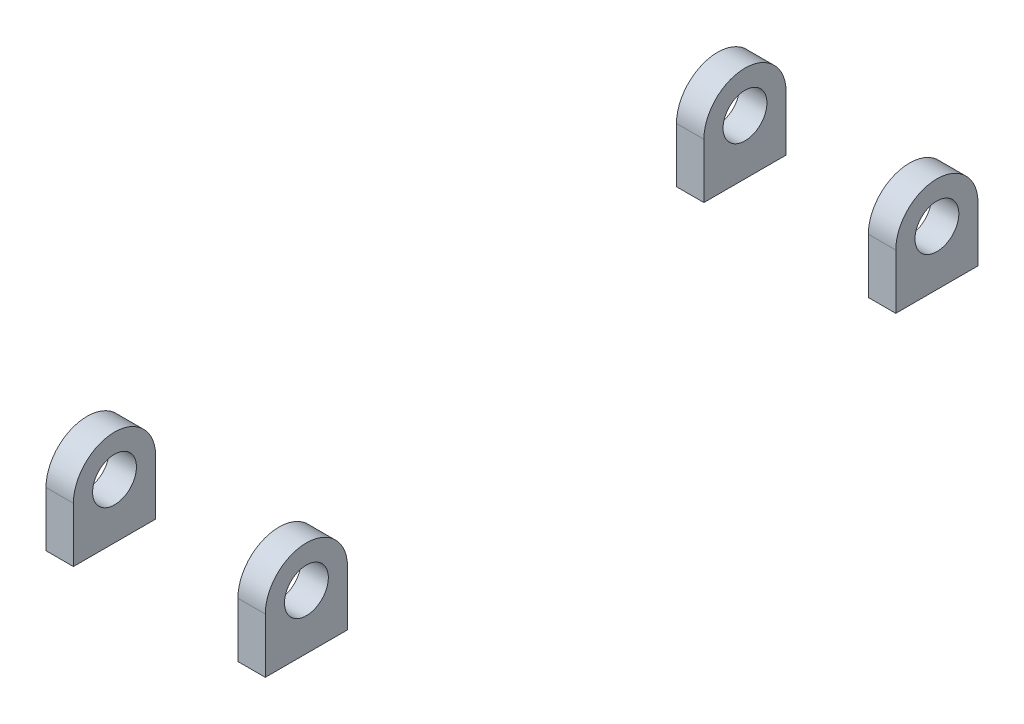
ISO-10303-21;
HEADER;
FILE_DESCRIPTION(('STEP AP214'),'2;1');
FILE_NAME('part.step','',(''),(''),'','','');
FILE_SCHEMA(('AUTOMOTIVE_DESIGN { 1 0 10303 214 1 1 1 1 }'));
ENDSEC;
DATA;
#1=APPLICATION_CONTEXT('core data for automotive mechanical design processes');
#2=APPLICATION_PROTOCOL_DEFINITION('international standard','automotive_design',2000,#1);
#3=PRODUCT_CONTEXT('',#1,'mechanical');
#4=PRODUCT('Part','Part','',(#3));
#5=PRODUCT_RELATED_PRODUCT_CATEGORY('part','',(#4));
#6=PRODUCT_DEFINITION_FORMATION('','',#4);
#7=PRODUCT_DEFINITION_CONTEXT('part definition',#1,'design');
#8=PRODUCT_DEFINITION('design','',#6,#7);
#9=PRODUCT_DEFINITION_SHAPE('','',#8);
#10=(LENGTH_UNIT() NAMED_UNIT(*) SI_UNIT(.MILLI.,.METRE.));
#11=(NAMED_UNIT(*) PLANE_ANGLE_UNIT() SI_UNIT($,.RADIAN.));
#12=(NAMED_UNIT(*) SI_UNIT($,.STERADIAN.) SOLID_ANGLE_UNIT());
#13=UNCERTAINTY_MEASURE_WITH_UNIT(LENGTH_MEASURE(1.E-05),#10,'distance_accuracy_value','');
#14=(GEOMETRIC_REPRESENTATION_CONTEXT(3) GLOBAL_UNCERTAINTY_ASSIGNED_CONTEXT((#13)) GLOBAL_UNIT_ASSIGNED_CONTEXT((#10,
#11,#12)) REPRESENTATION_CONTEXT('',''));
#15=CARTESIAN_POINT('',(0.,0.,0.));
#16=DIRECTION('',(0.,0.,1.));
#17=DIRECTION('',(1.,0.,0.));
#18=AXIS2_PLACEMENT_3D('',#15,#16,#17);
#19=CARTESIAN_POINT('',(20.,20.,-31.163525116419));
#20=DIRECTION('',(0.,0.,-1.));
#21=DIRECTION('',(-1.,0.,0.));
#22=AXIS2_PLACEMENT_3D('',#19,#20,#21);
#23=PLANE('',#22);
#24=DIRECTION('',(-1.,0.,0.));
#25=VECTOR('',#24,1.);
#26=CARTESIAN_POINT('',(20.,10.,-31.163525116419));
#27=LINE('',#26,#25);
#28=CARTESIAN_POINT('',(20.,10.,-31.163525116419));
#29=VERTEX_POINT('',#28);
#30=CARTESIAN_POINT('',(15.,10.,-31.163525116419));
#31=VERTEX_POINT('',#30);
#32=EDGE_CURVE('E98',#29,#31,#27,.T.);
#33=ORIENTED_EDGE('',*,*,#32,.T.);
#34=DIRECTION('',(0.,-1.,0.));
#35=VECTOR('',#34,1.);
#36=CARTESIAN_POINT('',(15.,20.,-31.163525116419));
#37=LINE('',#36,#35);
#38=CARTESIAN_POINT('',(15.,0.,-31.163525116419));
#39=VERTEX_POINT('',#38);
#40=EDGE_CURVE('E118',#31,#39,#37,.T.);
#41=ORIENTED_EDGE('',*,*,#40,.T.);
#42=DIRECTION('',(1.,0.,0.));
#43=VECTOR('',#42,1.);
#44=CARTESIAN_POINT('',(20.,0.,-31.163525116419));
#45=LINE('',#44,#43);
#46=CARTESIAN_POINT('',(20.,0.,-31.163525116419));
#47=VERTEX_POINT('',#46);
#48=EDGE_CURVE('E64',#39,#47,#45,.T.);
#49=ORIENTED_EDGE('',*,*,#48,.T.);
#50=DIRECTION('',(0.,-1.,0.));
#51=VECTOR('',#50,1.);
#52=CARTESIAN_POINT('',(20.,20.,-31.163525116419));
#53=LINE('',#52,#51);
#54=EDGE_CURVE('E78',#29,#47,#53,.T.);
#55=ORIENTED_EDGE('',*,*,#54,.F.);
#56=EDGE_LOOP('',(#33,#41,#49,#55));
#57=FACE_BOUND('',#56,.T.);
#58=ADVANCED_FACE('F54',(#57),#23,.F.);
#59=CARTESIAN_POINT('',(20.,20.,-31.163525116419));
#60=DIRECTION('',(-1.,0.,0.));
#61=DIRECTION('',(0.,0.,1.));
#62=AXIS2_PLACEMENT_3D('',#59,#60,#61);
#63=PLANE('',#62);
#64=CARTESIAN_POINT('',(20.,10.,-38.663525116419));
#65=DIRECTION('',(-1.,0.,0.));
#66=DIRECTION('',(0.,0.,1.));
#67=AXIS2_PLACEMENT_3D('',#64,#65,#66);
#68=CIRCLE('',#67,4.00000000000001);
#69=CARTESIAN_POINT('',(20.,10.,-34.663525116419));
#70=VERTEX_POINT('',#69);
#71=EDGE_CURVE('E101',#70,#70,#68,.T.);
#72=ORIENTED_EDGE('',*,*,#71,.T.);
#73=EDGE_LOOP('',(#72));
#74=FACE_BOUND('',#73,.T.);
#75=DIRECTION('',(0.,-1.,0.));
#76=VECTOR('',#75,1.);
#77=CARTESIAN_POINT('',(20.,20.,-46.163525116419));
#78=LINE('',#77,#76);
#79=CARTESIAN_POINT('',(20.,10.,-46.163525116419));
#80=VERTEX_POINT('',#79);
#81=CARTESIAN_POINT('',(20.,0.,-46.163525116419));
#82=VERTEX_POINT('',#81);
#83=EDGE_CURVE('E107',#80,#82,#78,.T.);
#84=ORIENTED_EDGE('',*,*,#83,.F.);
#85=CARTESIAN_POINT('',(20.,10.,-38.663525116419));
#86=DIRECTION('',(1.,0.,0.));
#87=DIRECTION('',(0.,0.,1.));
#88=AXIS2_PLACEMENT_3D('',#85,#86,#87);
#89=CIRCLE('',#88,7.5);
#90=EDGE_CURVE('E95',#80,#29,#89,.T.);
#91=ORIENTED_EDGE('',*,*,#90,.T.);
#92=ORIENTED_EDGE('',*,*,#54,.T.);
#93=DIRECTION('',(0.,0.,-1.));
#94=VECTOR('',#93,1.);
#95=CARTESIAN_POINT('',(20.,0.,-31.163525116419));
#96=LINE('',#95,#94);
#97=EDGE_CURVE('E112',#47,#82,#96,.T.);
#98=ORIENTED_EDGE('',*,*,#97,.T.);
#99=EDGE_LOOP('',(#84,#91,#92,#98));
#100=FACE_BOUND('',#99,.T.);
#101=ADVANCED_FACE('F111',(#74,#100),#63,.F.);
#102=CARTESIAN_POINT('',(20.,20.,-46.163525116419));
#103=DIRECTION('',(0.,0.,1.));
#104=DIRECTION('',(1.,0.,0.));
#105=AXIS2_PLACEMENT_3D('',#102,#103,#104);
#106=PLANE('',#105);
#107=DIRECTION('',(0.,-1.,0.));
#108=VECTOR('',#107,1.);
#109=CARTESIAN_POINT('',(15.,20.,-46.163525116419));
#110=LINE('',#109,#108);
#111=CARTESIAN_POINT('',(15.,10.,-46.163525116419));
#112=VERTEX_POINT('',#111);
#113=CARTESIAN_POINT('',(15.,0.,-46.163525116419));
#114=VERTEX_POINT('',#113);
#115=EDGE_CURVE('E108',#112,#114,#110,.T.);
#116=ORIENTED_EDGE('',*,*,#115,.F.);
#117=DIRECTION('',(-1.,0.,0.));
#118=VECTOR('',#117,1.);
#119=CARTESIAN_POINT('',(20.,10.,-46.163525116419));
#120=LINE('',#119,#118);
#121=EDGE_CURVE('E71',#80,#112,#120,.T.);
#122=ORIENTED_EDGE('',*,*,#121,.F.);
#123=ORIENTED_EDGE('',*,*,#83,.T.);
#124=DIRECTION('',(-1.,0.,0.));
#125=VECTOR('',#124,1.);
#126=CARTESIAN_POINT('',(20.,0.,-46.163525116419));
#127=LINE('',#126,#125);
#128=EDGE_CURVE('E128',#82,#114,#127,.T.);
#129=ORIENTED_EDGE('',*,*,#128,.T.);
#130=EDGE_LOOP('',(#116,#122,#123,#129));
#131=FACE_BOUND('',#130,.T.);
#132=ADVANCED_FACE('F105',(#131),#106,.F.);
#133=CARTESIAN_POINT('',(15.,20.,-31.163525116419));
#134=DIRECTION('',(1.,0.,0.));
#135=DIRECTION('',(0.,0.,-1.));
#136=AXIS2_PLACEMENT_3D('',#133,#134,#135);
#137=PLANE('',#136);
#138=CARTESIAN_POINT('',(15.,10.,-38.663525116419));
#139=DIRECTION('',(1.,0.,0.));
#140=DIRECTION('',(0.,0.,-1.));
#141=AXIS2_PLACEMENT_3D('',#138,#139,#140);
#142=CIRCLE('',#141,4.00000000000001);
#143=CARTESIAN_POINT('',(15.,10.,-42.663525116419));
#144=VERTEX_POINT('',#143);
#145=EDGE_CURVE('E58',#144,#144,#142,.T.);
#146=ORIENTED_EDGE('',*,*,#145,.T.);
#147=EDGE_LOOP('',(#146));
#148=FACE_BOUND('',#147,.T.);
#149=ORIENTED_EDGE('',*,*,#40,.F.);
#150=CARTESIAN_POINT('',(15.,10.,-38.663525116419));
#151=DIRECTION('',(1.,0.,0.));
#152=DIRECTION('',(0.,0.,-1.));
#153=AXIS2_PLACEMENT_3D('',#150,#151,#152);
#154=CIRCLE('',#153,7.5);
#155=EDGE_CURVE('E12',#31,#112,#154,.F.);
#156=ORIENTED_EDGE('',*,*,#155,.T.);
#157=ORIENTED_EDGE('',*,*,#115,.T.);
#158=DIRECTION('',(0.,0.,1.));
#159=VECTOR('',#158,1.);
#160=CARTESIAN_POINT('',(15.,0.,-31.163525116419));
#161=LINE('',#160,#159);
#162=EDGE_CURVE('E124',#114,#39,#161,.T.);
#163=ORIENTED_EDGE('',*,*,#162,.T.);
#164=EDGE_LOOP('',(#149,#156,#157,#163));
#165=FACE_BOUND('',#164,.T.);
#166=ADVANCED_FACE('F141',(#148,#165),#137,.F.);
#167=CARTESIAN_POINT('',(0.,0.,0.));
#168=DIRECTION('',(0.,-1.,0.));
#169=DIRECTION('',(0.,0.,-1.));
#170=AXIS2_PLACEMENT_3D('',#167,#168,#169);
#171=PLANE('',#170);
#172=ORIENTED_EDGE('',*,*,#48,.F.);
#173=ORIENTED_EDGE('',*,*,#162,.F.);
#174=ORIENTED_EDGE('',*,*,#128,.F.);
#175=ORIENTED_EDGE('',*,*,#97,.F.);
#176=EDGE_LOOP('',(#172,#173,#174,#175));
#177=FACE_BOUND('',#176,.T.);
#178=ADVANCED_FACE('F56',(#177),#171,.T.);
#179=CARTESIAN_POINT('',(20.,10.,-38.663525116419));
#180=DIRECTION('',(-1.,0.,0.));
#181=DIRECTION('',(0.,0.,1.));
#182=AXIS2_PLACEMENT_3D('',#179,#180,#181);
#183=CYLINDRICAL_SURFACE('',#182,7.5);
#184=ORIENTED_EDGE('',*,*,#32,.F.);
#185=ORIENTED_EDGE('',*,*,#90,.F.);
#186=ORIENTED_EDGE('',*,*,#121,.T.);
#187=ORIENTED_EDGE('',*,*,#155,.F.);
#188=EDGE_LOOP('',(#184,#185,#186,#187));
#189=FACE_BOUND('',#188,.T.);
#190=ADVANCED_FACE('F96',(#189),#183,.T.);
#191=CARTESIAN_POINT('',(20.,10.,-38.663525116419));
#192=DIRECTION('',(-1.,0.,0.));
#193=DIRECTION('',(0.,0.,1.));
#194=AXIS2_PLACEMENT_3D('',#191,#192,#193);
#195=CYLINDRICAL_SURFACE('',#194,4.00000000000001);
#196=ORIENTED_EDGE('',*,*,#71,.F.);
#197=EDGE_LOOP('',(#196));
#198=FACE_BOUND('',#197,.T.);
#199=ORIENTED_EDGE('',*,*,#145,.F.);
#200=EDGE_LOOP('',(#199));
#201=FACE_BOUND('',#200,.T.);
#202=ADVANCED_FACE('F154',(#198,#201),#195,.F.);
#203=CLOSED_SHELL('',(#58,#101,#132,#166,#178,#190,#202));
#204=MANIFOLD_SOLID_BREP('B2',#203);
#205=CARTESIAN_POINT('',(20.,20.,83.836474883581));
#206=DIRECTION('',(0.,0.,-1.));
#207=DIRECTION('',(-1.,0.,0.));
#208=AXIS2_PLACEMENT_3D('',#205,#206,#207);
#209=PLANE('',#208);
#210=DIRECTION('',(-1.,0.,0.));
#211=VECTOR('',#210,1.);
#212=CARTESIAN_POINT('',(20.0000000000001,10.,83.836474883581));
#213=LINE('',#212,#211);
#214=CARTESIAN_POINT('',(20.,10.,83.836474883581));
#215=VERTEX_POINT('',#214);
#216=CARTESIAN_POINT('',(15.,10.,83.836474883581));
#217=VERTEX_POINT('',#216);
#218=EDGE_CURVE('E252',#215,#217,#213,.T.);
#219=ORIENTED_EDGE('',*,*,#218,.T.);
#220=DIRECTION('',(0.,-1.,0.));
#221=VECTOR('',#220,1.);
#222=CARTESIAN_POINT('',(15.,20.,83.836474883581));
#223=LINE('',#222,#221);
#224=CARTESIAN_POINT('',(15.,0.,83.836474883581));
#225=VERTEX_POINT('',#224);
#226=EDGE_CURVE('E300',#217,#225,#223,.T.);
#227=ORIENTED_EDGE('',*,*,#226,.T.);
#228=DIRECTION('',(1.,0.,0.));
#229=VECTOR('',#228,1.);
#230=CARTESIAN_POINT('',(20.,0.,83.836474883581));
#231=LINE('',#230,#229);
#232=CARTESIAN_POINT('',(20.,0.,83.836474883581));
#233=VERTEX_POINT('',#232);
#234=EDGE_CURVE('E298',#225,#233,#231,.T.);
#235=ORIENTED_EDGE('',*,*,#234,.T.);
#236=DIRECTION('',(0.,-1.,0.));
#237=VECTOR('',#236,1.);
#238=CARTESIAN_POINT('',(20.,20.,83.836474883581));
#239=LINE('',#238,#237);
#240=EDGE_CURVE('E296',#215,#233,#239,.T.);
#241=ORIENTED_EDGE('',*,*,#240,.F.);
#242=EDGE_LOOP('',(#219,#227,#235,#241));
#243=FACE_BOUND('',#242,.T.);
#244=ADVANCED_FACE('F237',(#243),#209,.F.);
#245=CARTESIAN_POINT('',(20.,20.,68.836474883581));
#246=DIRECTION('',(0.,0.,1.));
#247=DIRECTION('',(1.,0.,0.));
#248=AXIS2_PLACEMENT_3D('',#245,#246,#247);
#249=PLANE('',#248);
#250=DIRECTION('',(0.,-1.,0.));
#251=VECTOR('',#250,1.);
#252=CARTESIAN_POINT('',(15.,20.,68.836474883581));
#253=LINE('',#252,#251);
#254=CARTESIAN_POINT('',(15.,10.,68.836474883581));
#255=VERTEX_POINT('',#254);
#256=CARTESIAN_POINT('',(15.,0.,68.836474883581));
#257=VERTEX_POINT('',#256);
#258=EDGE_CURVE('E260',#255,#257,#253,.T.);
#259=ORIENTED_EDGE('',*,*,#258,.F.);
#260=DIRECTION('',(-1.,0.,0.));
#261=VECTOR('',#260,1.);
#262=CARTESIAN_POINT('',(20.,10.,68.836474883581));
#263=LINE('',#262,#261);
#264=CARTESIAN_POINT('',(20.,10.,68.836474883581));
#265=VERTEX_POINT('',#264);
#266=EDGE_CURVE('E280',#265,#255,#263,.T.);
#267=ORIENTED_EDGE('',*,*,#266,.F.);
#268=DIRECTION('',(0.,-1.,0.));
#269=VECTOR('',#268,1.);
#270=CARTESIAN_POINT('',(20.,20.,68.836474883581));
#271=LINE('',#270,#269);
#272=CARTESIAN_POINT('',(20.,0.,68.836474883581));
#273=VERTEX_POINT('',#272);
#274=EDGE_CURVE('E288',#265,#273,#271,.T.);
#275=ORIENTED_EDGE('',*,*,#274,.T.);
#276=DIRECTION('',(-1.,0.,0.));
#277=VECTOR('',#276,1.);
#278=CARTESIAN_POINT('',(20.,0.,68.836474883581));
#279=LINE('',#278,#277);
#280=EDGE_CURVE('E52',#273,#257,#279,.T.);
#281=ORIENTED_EDGE('',*,*,#280,.T.);
#282=EDGE_LOOP('',(#259,#267,#275,#281));
#283=FACE_BOUND('',#282,.T.);
#284=ADVANCED_FACE('F287',(#283),#249,.F.);
#285=CARTESIAN_POINT('',(15.,20.,68.836474883581));
#286=DIRECTION('',(1.,0.,0.));
#287=DIRECTION('',(0.,0.,-1.));
#288=AXIS2_PLACEMENT_3D('',#285,#286,#287);
#289=PLANE('',#288);
#290=CARTESIAN_POINT('',(15.,10.,76.336474883581));
#291=DIRECTION('',(1.,0.,0.));
#292=DIRECTION('',(0.,0.,-1.));
#293=AXIS2_PLACEMENT_3D('',#290,#291,#292);
#294=CIRCLE('',#293,4.00000000000001);
#295=CARTESIAN_POINT('',(15.,10.,72.336474883581));
#296=VERTEX_POINT('',#295);
#297=EDGE_CURVE('E284',#296,#296,#294,.T.);
#298=ORIENTED_EDGE('',*,*,#297,.T.);
#299=EDGE_LOOP('',(#298));
#300=FACE_BOUND('',#299,.T.);
#301=ORIENTED_EDGE('',*,*,#226,.F.);
#302=CARTESIAN_POINT('',(15.,10.,76.336474883581));
#303=DIRECTION('',(1.,0.,0.));
#304=DIRECTION('',(0.,0.,-1.));
#305=AXIS2_PLACEMENT_3D('',#302,#303,#304);
#306=CIRCLE('',#305,7.5);
#307=EDGE_CURVE('E310',#217,#255,#306,.F.);
#308=ORIENTED_EDGE('',*,*,#307,.T.);
#309=ORIENTED_EDGE('',*,*,#258,.T.);
#310=DIRECTION('',(0.,0.,1.));
#311=VECTOR('',#310,1.);
#312=CARTESIAN_POINT('',(15.,0.,68.836474883581));
#313=LINE('',#312,#311);
#314=EDGE_CURVE('E245',#257,#225,#313,.T.);
#315=ORIENTED_EDGE('',*,*,#314,.T.);
#316=EDGE_LOOP('',(#301,#308,#309,#315));
#317=FACE_BOUND('',#316,.T.);
#318=ADVANCED_FACE('F307',(#300,#317),#289,.F.);
#319=CARTESIAN_POINT('',(20.,20.,68.836474883581));
#320=DIRECTION('',(-1.,0.,0.));
#321=DIRECTION('',(0.,0.,1.));
#322=AXIS2_PLACEMENT_3D('',#319,#320,#321);
#323=PLANE('',#322);
#324=CARTESIAN_POINT('',(20.,10.,76.336474883581));
#325=DIRECTION('',(-1.,0.,0.));
#326=DIRECTION('',(0.,0.,1.));
#327=AXIS2_PLACEMENT_3D('',#324,#325,#326);
#328=CIRCLE('',#327,4.00000000000001);
#329=CARTESIAN_POINT('',(20.,10.,80.336474883581));
#330=VERTEX_POINT('',#329);
#331=EDGE_CURVE('E290',#330,#330,#328,.T.);
#332=ORIENTED_EDGE('',*,*,#331,.T.);
#333=EDGE_LOOP('',(#332));
#334=FACE_BOUND('',#333,.T.);
#335=ORIENTED_EDGE('',*,*,#274,.F.);
#336=CARTESIAN_POINT('',(20.,10.,76.336474883581));
#337=DIRECTION('',(1.,0.,0.));
#338=DIRECTION('',(0.,0.,1.));
#339=AXIS2_PLACEMENT_3D('',#336,#337,#338);
#340=CIRCLE('',#339,7.5);
#341=EDGE_CURVE('E277',#265,#215,#340,.T.);
#342=ORIENTED_EDGE('',*,*,#341,.T.);
#343=ORIENTED_EDGE('',*,*,#240,.T.);
#344=DIRECTION('',(0.,0.,-1.));
#345=VECTOR('',#344,1.);
#346=CARTESIAN_POINT('',(20.,0.,68.836474883581));
#347=LINE('',#346,#345);
#348=EDGE_CURVE('E294',#233,#273,#347,.T.);
#349=ORIENTED_EDGE('',*,*,#348,.T.);
#350=EDGE_LOOP('',(#335,#342,#343,#349));
#351=FACE_BOUND('',#350,.T.);
#352=ADVANCED_FACE('F292',(#334,#351),#323,.F.);
#353=CARTESIAN_POINT('',(0.,0.,0.));
#354=DIRECTION('',(0.,1.,0.));
#355=DIRECTION('',(0.,0.,1.));
#356=AXIS2_PLACEMENT_3D('',#353,#354,#355);
#357=PLANE('',#356);
#358=ORIENTED_EDGE('',*,*,#280,.F.);
#359=ORIENTED_EDGE('',*,*,#348,.F.);
#360=ORIENTED_EDGE('',*,*,#234,.F.);
#361=ORIENTED_EDGE('',*,*,#314,.F.);
#362=EDGE_LOOP('',(#358,#359,#360,#361));
#363=FACE_BOUND('',#362,.T.);
#364=ADVANCED_FACE('F239',(#363),#357,.F.);
#365=CARTESIAN_POINT('',(20.,10.,76.336474883581));
#366=DIRECTION('',(-1.,0.,0.));
#367=DIRECTION('',(0.,0.,1.));
#368=AXIS2_PLACEMENT_3D('',#365,#366,#367);
#369=CYLINDRICAL_SURFACE('',#368,4.00000000000001);
#370=ORIENTED_EDGE('',*,*,#331,.F.);
#371=EDGE_LOOP('',(#370));
#372=FACE_BOUND('',#371,.T.);
#373=ORIENTED_EDGE('',*,*,#297,.F.);
#374=EDGE_LOOP('',(#373));
#375=FACE_BOUND('',#374,.T.);
#376=ADVANCED_FACE('F321',(#372,#375),#369,.F.);
#377=CARTESIAN_POINT('',(20.,10.,76.336474883581));
#378=DIRECTION('',(-1.,0.,0.));
#379=DIRECTION('',(0.,0.,1.));
#380=AXIS2_PLACEMENT_3D('',#377,#378,#379);
#381=CYLINDRICAL_SURFACE('',#380,7.5);
#382=ORIENTED_EDGE('',*,*,#218,.F.);
#383=ORIENTED_EDGE('',*,*,#341,.F.);
#384=ORIENTED_EDGE('',*,*,#266,.T.);
#385=ORIENTED_EDGE('',*,*,#307,.F.);
#386=EDGE_LOOP('',(#382,#383,#384,#385));
#387=FACE_BOUND('',#386,.T.);
#388=ADVANCED_FACE('F279',(#387),#381,.T.);
#389=CLOSED_SHELL('',(#244,#284,#318,#352,#364,#376,#388));
#390=MANIFOLD_SOLID_BREP('B6',#389);
#391=CARTESIAN_POINT('',(-20.,20.,-31.163525116419));
#392=DIRECTION('',(0.,0.,-1.));
#393=DIRECTION('',(-1.,0.,0.));
#394=AXIS2_PLACEMENT_3D('',#391,#392,#393);
#395=PLANE('',#394);
#396=DIRECTION('',(-1.,0.,0.));
#397=VECTOR('',#396,1.);
#398=CARTESIAN_POINT('',(20.,10.,-31.163525116419));
#399=LINE('',#398,#397);
#400=CARTESIAN_POINT('',(-15.,10.,-31.163525116419));
#401=VERTEX_POINT('',#400);
#402=CARTESIAN_POINT('',(-20.,10.,-31.163525116419));
#403=VERTEX_POINT('',#402);
#404=EDGE_CURVE('E453',#401,#403,#399,.T.);
#405=ORIENTED_EDGE('',*,*,#404,.T.);
#406=DIRECTION('',(0.,-1.,0.));
#407=VECTOR('',#406,1.);
#408=CARTESIAN_POINT('',(-20.,20.,-31.163525116419));
#409=LINE('',#408,#407);
#410=CARTESIAN_POINT('',(-20.,0.,-31.163525116419));
#411=VERTEX_POINT('',#410);
#412=EDGE_CURVE('E429',#403,#411,#409,.T.);
#413=ORIENTED_EDGE('',*,*,#412,.T.);
#414=DIRECTION('',(1.,0.,0.));
#415=VECTOR('',#414,1.);
#416=CARTESIAN_POINT('',(-20.,0.,-31.163525116419));
#417=LINE('',#416,#415);
#418=CARTESIAN_POINT('',(-15.,0.,-31.163525116419));
#419=VERTEX_POINT('',#418);
#420=EDGE_CURVE('E414',#411,#419,#417,.T.);
#421=ORIENTED_EDGE('',*,*,#420,.T.);
#422=DIRECTION('',(0.,-1.,0.));
#423=VECTOR('',#422,1.);
#424=CARTESIAN_POINT('',(-15.,20.,-31.163525116419));
#425=LINE('',#424,#423);
#426=EDGE_CURVE('E469',#401,#419,#425,.T.);
#427=ORIENTED_EDGE('',*,*,#426,.F.);
#428=EDGE_LOOP('',(#405,#413,#421,#427));
#429=FACE_BOUND('',#428,.T.);
#430=ADVANCED_FACE('F405',(#429),#395,.F.);
#431=CARTESIAN_POINT('',(-20.,20.,-31.163525116419));
#432=DIRECTION('',(1.,0.,0.));
#433=DIRECTION('',(0.,0.,-1.));
#434=AXIS2_PLACEMENT_3D('',#431,#432,#433);
#435=PLANE('',#434);
#436=CARTESIAN_POINT('',(-20.,10.,-38.663525116419));
#437=DIRECTION('',(-1.,0.,0.));
#438=DIRECTION('',(0.,0.,1.));
#439=AXIS2_PLACEMENT_3D('',#436,#437,#438);
#440=CIRCLE('',#439,4.00000000000001);
#441=CARTESIAN_POINT('',(-20.,10.,-34.663525116419));
#442=VERTEX_POINT('',#441);
#443=EDGE_CURVE('E459',#442,#442,#440,.T.);
#444=ORIENTED_EDGE('',*,*,#443,.F.);
#445=EDGE_LOOP('',(#444));
#446=FACE_BOUND('',#445,.T.);
#447=ORIENTED_EDGE('',*,*,#412,.F.);
#448=CARTESIAN_POINT('',(-20.,10.,-38.663525116419));
#449=DIRECTION('',(1.,0.,0.));
#450=DIRECTION('',(0.,0.,1.));
#451=AXIS2_PLACEMENT_3D('',#448,#449,#450);
#452=CIRCLE('',#451,7.5);
#453=CARTESIAN_POINT('',(-20.,10.,-46.163525116419));
#454=VERTEX_POINT('',#453);
#455=EDGE_CURVE('E449',#454,#403,#452,.T.);
#456=ORIENTED_EDGE('',*,*,#455,.F.);
#457=DIRECTION('',(0.,-1.,0.));
#458=VECTOR('',#457,1.);
#459=CARTESIAN_POINT('',(-20.,20.,-46.163525116419));
#460=LINE('',#459,#458);
#461=CARTESIAN_POINT('',(-20.,0.,-46.163525116419));
#462=VERTEX_POINT('',#461);
#463=EDGE_CURVE('E457',#454,#462,#460,.T.);
#464=ORIENTED_EDGE('',*,*,#463,.T.);
#465=DIRECTION('',(0.,0.,1.));
#466=VECTOR('',#465,1.);
#467=CARTESIAN_POINT('',(-20.,0.,-31.163525116419));
#468=LINE('',#467,#466);
#469=EDGE_CURVE('E235',#462,#411,#468,.T.);
#470=ORIENTED_EDGE('',*,*,#469,.T.);
#471=EDGE_LOOP('',(#447,#456,#464,#470));
#472=FACE_BOUND('',#471,.T.);
#473=ADVANCED_FACE('F456',(#446,#472),#435,.F.);
#474=CARTESIAN_POINT('',(-15.,20.,-31.163525116419));
#475=DIRECTION('',(-1.,0.,0.));
#476=DIRECTION('',(0.,0.,1.));
#477=AXIS2_PLACEMENT_3D('',#474,#475,#476);
#478=PLANE('',#477);
#479=CARTESIAN_POINT('',(-15.,10.,-38.663525116419));
#480=DIRECTION('',(-1.,0.,0.));
#481=DIRECTION('',(0.,0.,1.));
#482=AXIS2_PLACEMENT_3D('',#479,#480,#481);
#483=CIRCLE('',#482,4.00000000000001);
#484=CARTESIAN_POINT('',(-15.,10.,-34.663525116419));
#485=VERTEX_POINT('',#484);
#486=EDGE_CURVE('E409',#485,#485,#483,.T.);
#487=ORIENTED_EDGE('',*,*,#486,.T.);
#488=EDGE_LOOP('',(#487));
#489=FACE_BOUND('',#488,.T.);
#490=DIRECTION('',(0.,-1.,0.));
#491=VECTOR('',#490,1.);
#492=CARTESIAN_POINT('',(-15.,20.,-46.163525116419));
#493=LINE('',#492,#491);
#494=CARTESIAN_POINT('',(-15.,10.,-46.163525116419));
#495=VERTEX_POINT('',#494);
#496=CARTESIAN_POINT('',(-15.,0.,-46.163525116419));
#497=VERTEX_POINT('',#496);
#498=EDGE_CURVE('E465',#495,#497,#493,.T.);
#499=ORIENTED_EDGE('',*,*,#498,.F.);
#500=CARTESIAN_POINT('',(-15.,10.,-38.663525116419));
#501=DIRECTION('',(-1.,0.,0.));
#502=DIRECTION('',(0.,0.,1.));
#503=AXIS2_PLACEMENT_3D('',#500,#501,#502);
#504=CIRCLE('',#503,7.5);
#505=EDGE_CURVE('E421',#495,#401,#504,.F.);
#506=ORIENTED_EDGE('',*,*,#505,.T.);
#507=ORIENTED_EDGE('',*,*,#426,.T.);
#508=DIRECTION('',(0.,0.,-1.));
#509=VECTOR('',#508,1.);
#510=CARTESIAN_POINT('',(-15.,0.,-31.163525116419));
#511=LINE('',#510,#509);
#512=EDGE_CURVE('E467',#419,#497,#511,.T.);
#513=ORIENTED_EDGE('',*,*,#512,.T.);
#514=EDGE_LOOP('',(#499,#506,#507,#513));
#515=FACE_BOUND('',#514,.T.);
#516=ADVANCED_FACE('F479',(#489,#515),#478,.F.);
#517=CARTESIAN_POINT('',(-20.,20.,-46.163525116419));
#518=DIRECTION('',(0.,0.,1.));
#519=DIRECTION('',(1.,0.,0.));
#520=AXIS2_PLACEMENT_3D('',#517,#518,#519);
#521=PLANE('',#520);
#522=ORIENTED_EDGE('',*,*,#463,.F.);
#523=DIRECTION('',(-1.,0.,0.));
#524=VECTOR('',#523,1.);
#525=CARTESIAN_POINT('',(20.,10.,-46.163525116419));
#526=LINE('',#525,#524);
#527=EDGE_CURVE('E446',#495,#454,#526,.T.);
#528=ORIENTED_EDGE('',*,*,#527,.F.);
#529=ORIENTED_EDGE('',*,*,#498,.T.);
#530=DIRECTION('',(-1.,0.,0.));
#531=VECTOR('',#530,1.);
#532=CARTESIAN_POINT('',(-20.,0.,-46.163525116419));
#533=LINE('',#532,#531);
#534=EDGE_CURVE('E463',#497,#462,#533,.T.);
#535=ORIENTED_EDGE('',*,*,#534,.T.);
#536=EDGE_LOOP('',(#522,#528,#529,#535));
#537=FACE_BOUND('',#536,.T.);
#538=ADVANCED_FACE('F461',(#537),#521,.F.);
#539=CARTESIAN_POINT('',(0.,0.,0.));
#540=DIRECTION('',(0.,-1.,0.));
#541=DIRECTION('',(0.,0.,-1.));
#542=AXIS2_PLACEMENT_3D('',#539,#540,#541);
#543=PLANE('',#542);
#544=ORIENTED_EDGE('',*,*,#469,.F.);
#545=ORIENTED_EDGE('',*,*,#534,.F.);
#546=ORIENTED_EDGE('',*,*,#512,.F.);
#547=ORIENTED_EDGE('',*,*,#420,.F.);
#548=EDGE_LOOP('',(#544,#545,#546,#547));
#549=FACE_BOUND('',#548,.T.);
#550=ADVANCED_FACE('F407',(#549),#543,.T.);
#551=CARTESIAN_POINT('',(20.,10.,-38.663525116419));
#552=DIRECTION('',(-1.,0.,0.));
#553=DIRECTION('',(0.,0.,1.));
#554=AXIS2_PLACEMENT_3D('',#551,#552,#553);
#555=CYLINDRICAL_SURFACE('',#554,7.5);
#556=ORIENTED_EDGE('',*,*,#527,.T.);
#557=ORIENTED_EDGE('',*,*,#455,.T.);
#558=ORIENTED_EDGE('',*,*,#404,.F.);
#559=ORIENTED_EDGE('',*,*,#505,.F.);
#560=EDGE_LOOP('',(#556,#557,#558,#559));
#561=FACE_BOUND('',#560,.T.);
#562=ADVANCED_FACE('F448',(#561),#555,.T.);
#563=CARTESIAN_POINT('',(20.,10.,-38.663525116419));
#564=DIRECTION('',(-1.,0.,0.));
#565=DIRECTION('',(0.,0.,1.));
#566=AXIS2_PLACEMENT_3D('',#563,#564,#565);
#567=CYLINDRICAL_SURFACE('',#566,4.00000000000001);
#568=ORIENTED_EDGE('',*,*,#443,.T.);
#569=EDGE_LOOP('',(#568));
#570=FACE_BOUND('',#569,.T.);
#571=ORIENTED_EDGE('',*,*,#486,.F.);
#572=EDGE_LOOP('',(#571));
#573=FACE_BOUND('',#572,.T.);
#574=ADVANCED_FACE('F487',(#570,#573),#567,.F.);
#575=CLOSED_SHELL('',(#430,#473,#516,#538,#550,#562,#574));
#576=MANIFOLD_SOLID_BREP('B46',#575);
#577=CARTESIAN_POINT('',(-20.,20.,83.836474883581));
#578=DIRECTION('',(0.,0.,-1.));
#579=DIRECTION('',(-1.,0.,0.));
#580=AXIS2_PLACEMENT_3D('',#577,#578,#579);
#581=PLANE('',#580);
#582=DIRECTION('',(-1.,0.,0.));
#583=VECTOR('',#582,1.);
#584=CARTESIAN_POINT('',(20.0000000000001,10.,83.836474883581));
#585=LINE('',#584,#583);
#586=CARTESIAN_POINT('',(-15.,10.,83.836474883581));
#587=VERTEX_POINT('',#586);
#588=CARTESIAN_POINT('',(-20.,10.,83.836474883581));
#589=VERTEX_POINT('',#588);
#590=EDGE_CURVE('E610',#587,#589,#585,.T.);
#591=ORIENTED_EDGE('',*,*,#590,.T.);
#592=DIRECTION('',(0.,-1.,0.));
#593=VECTOR('',#592,1.);
#594=CARTESIAN_POINT('',(-20.,20.,83.836474883581));
#595=LINE('',#594,#593);
#596=CARTESIAN_POINT('',(-20.,0.,83.836474883581));
#597=VERTEX_POINT('',#596);
#598=EDGE_CURVE('E403',#589,#597,#595,.T.);
#599=ORIENTED_EDGE('',*,*,#598,.T.);
#600=DIRECTION('',(1.,0.,0.));
#601=VECTOR('',#600,1.);
#602=CARTESIAN_POINT('',(-20.,0.,83.836474883581));
#603=LINE('',#602,#601);
#604=CARTESIAN_POINT('',(-15.,0.,83.836474883581));
#605=VERTEX_POINT('',#604);
#606=EDGE_CURVE('E634',#597,#605,#603,.T.);
#607=ORIENTED_EDGE('',*,*,#606,.T.);
#608=DIRECTION('',(0.,-1.,0.));
#609=VECTOR('',#608,1.);
#610=CARTESIAN_POINT('',(-15.,20.,83.836474883581));
#611=LINE('',#610,#609);
#612=EDGE_CURVE('E573',#587,#605,#611,.T.);
#613=ORIENTED_EDGE('',*,*,#612,.F.);
#614=EDGE_LOOP('',(#591,#599,#607,#613));
#615=FACE_BOUND('',#614,.T.);
#616=ADVANCED_FACE('F564',(#615),#581,.F.);
#617=CARTESIAN_POINT('',(-20.,20.,68.836474883581));
#618=DIRECTION('',(1.,0.,0.));
#619=DIRECTION('',(0.,0.,-1.));
#620=AXIS2_PLACEMENT_3D('',#617,#618,#619);
#621=PLANE('',#620);
#622=CARTESIAN_POINT('',(-20.,10.,76.336474883581));
#623=DIRECTION('',(-1.,0.,0.));
#624=DIRECTION('',(0.,0.,1.));
#625=AXIS2_PLACEMENT_3D('',#622,#623,#624);
#626=CIRCLE('',#625,4.00000000000001);
#627=CARTESIAN_POINT('',(-20.,10.,80.336474883581));
#628=VERTEX_POINT('',#627);
#629=EDGE_CURVE('E611',#628,#628,#626,.T.);
#630=ORIENTED_EDGE('',*,*,#629,.F.);
#631=EDGE_LOOP('',(#630));
#632=FACE_BOUND('',#631,.T.);
#633=ORIENTED_EDGE('',*,*,#598,.F.);
#634=CARTESIAN_POINT('',(-20.,10.,76.336474883581));
#635=DIRECTION('',(1.,0.,0.));
#636=DIRECTION('',(0.,0.,1.));
#637=AXIS2_PLACEMENT_3D('',#634,#635,#636);
#638=CIRCLE('',#637,7.5);
#639=CARTESIAN_POINT('',(-20.,10.,68.836474883581));
#640=VERTEX_POINT('',#639);
#641=EDGE_CURVE('E606',#640,#589,#638,.T.);
#642=ORIENTED_EDGE('',*,*,#641,.F.);
#643=DIRECTION('',(0.,-1.,0.));
#644=VECTOR('',#643,1.);
#645=CARTESIAN_POINT('',(-20.,20.,68.836474883581));
#646=LINE('',#645,#644);
#647=CARTESIAN_POINT('',(-20.,0.,68.836474883581));
#648=VERTEX_POINT('',#647);
#649=EDGE_CURVE('E588',#640,#648,#646,.T.);
#650=ORIENTED_EDGE('',*,*,#649,.T.);
#651=DIRECTION('',(0.,0.,1.));
#652=VECTOR('',#651,1.);
#653=CARTESIAN_POINT('',(-20.,0.,68.836474883581));
#654=LINE('',#653,#652);
#655=EDGE_CURVE('E636',#648,#597,#654,.T.);
#656=ORIENTED_EDGE('',*,*,#655,.T.);
#657=EDGE_LOOP('',(#633,#642,#650,#656));
#658=FACE_BOUND('',#657,.T.);
#659=ADVANCED_FACE('F566',(#632,#658),#621,.F.);
#660=CARTESIAN_POINT('',(-15.,20.,68.836474883581));
#661=DIRECTION('',(-1.,0.,0.));
#662=DIRECTION('',(0.,0.,1.));
#663=AXIS2_PLACEMENT_3D('',#660,#661,#662);
#664=PLANE('',#663);
#665=CARTESIAN_POINT('',(-15.,10.,76.336474883581));
#666=DIRECTION('',(-1.,0.,0.));
#667=DIRECTION('',(0.,0.,1.));
#668=AXIS2_PLACEMENT_3D('',#665,#666,#667);
#669=CIRCLE('',#668,4.00000000000001);
#670=CARTESIAN_POINT('',(-15.,10.,80.336474883581));
#671=VERTEX_POINT('',#670);
#672=EDGE_CURVE('E568',#671,#671,#669,.T.);
#673=ORIENTED_EDGE('',*,*,#672,.T.);
#674=EDGE_LOOP('',(#673));
#675=FACE_BOUND('',#674,.T.);
#676=DIRECTION('',(0.,-1.,0.));
#677=VECTOR('',#676,1.);
#678=CARTESIAN_POINT('',(-15.,20.,68.836474883581));
#679=LINE('',#678,#677);
#680=CARTESIAN_POINT('',(-15.,10.,68.836474883581));
#681=VERTEX_POINT('',#680);
#682=CARTESIAN_POINT('',(-15.,0.,68.836474883581));
#683=VERTEX_POINT('',#682);
#684=EDGE_CURVE('E619',#681,#683,#679,.T.);
#685=ORIENTED_EDGE('',*,*,#684,.F.);
#686=CARTESIAN_POINT('',(-15.,10.,76.336474883581));
#687=DIRECTION('',(-1.,0.,0.));
#688=DIRECTION('',(0.,0.,1.));
#689=AXIS2_PLACEMENT_3D('',#686,#687,#688);
#690=CIRCLE('',#689,7.5);
#691=EDGE_CURVE('E580',#681,#587,#690,.F.);
#692=ORIENTED_EDGE('',*,*,#691,.T.);
#693=ORIENTED_EDGE('',*,*,#612,.T.);
#694=DIRECTION('',(0.,0.,-1.));
#695=VECTOR('',#694,1.);
#696=CARTESIAN_POINT('',(-15.,0.,68.836474883581));
#697=LINE('',#696,#695);
#698=EDGE_CURVE('E622',#605,#683,#697,.T.);
#699=ORIENTED_EDGE('',*,*,#698,.T.);
#700=EDGE_LOOP('',(#685,#692,#693,#699));
#701=FACE_BOUND('',#700,.T.);
#702=ADVANCED_FACE('F630',(#675,#701),#664,.F.);
#703=CARTESIAN_POINT('',(-20.,20.,68.836474883581));
#704=DIRECTION('',(0.,0.,1.));
#705=DIRECTION('',(1.,0.,0.));
#706=AXIS2_PLACEMENT_3D('',#703,#704,#705);
#707=PLANE('',#706);
#708=ORIENTED_EDGE('',*,*,#649,.F.);
#709=DIRECTION('',(-1.,0.,0.));
#710=VECTOR('',#709,1.);
#711=CARTESIAN_POINT('',(20.,10.,68.836474883581));
#712=LINE('',#711,#710);
#713=EDGE_CURVE('E604',#681,#640,#712,.T.);
#714=ORIENTED_EDGE('',*,*,#713,.F.);
#715=ORIENTED_EDGE('',*,*,#684,.T.);
#716=DIRECTION('',(-1.,0.,0.));
#717=VECTOR('',#716,1.);
#718=CARTESIAN_POINT('',(-20.,0.,68.836474883581));
#719=LINE('',#718,#717);
#720=EDGE_CURVE('E617',#683,#648,#719,.T.);
#721=ORIENTED_EDGE('',*,*,#720,.T.);
#722=EDGE_LOOP('',(#708,#714,#715,#721));
#723=FACE_BOUND('',#722,.T.);
#724=ADVANCED_FACE('F615',(#723),#707,.F.);
#725=CARTESIAN_POINT('',(0.,0.,0.));
#726=DIRECTION('',(0.,1.,0.));
#727=DIRECTION('',(0.,0.,1.));
#728=AXIS2_PLACEMENT_3D('',#725,#726,#727);
#729=PLANE('',#728);
#730=ORIENTED_EDGE('',*,*,#655,.F.);
#731=ORIENTED_EDGE('',*,*,#720,.F.);
#732=ORIENTED_EDGE('',*,*,#698,.F.);
#733=ORIENTED_EDGE('',*,*,#606,.F.);
#734=EDGE_LOOP('',(#730,#731,#732,#733));
#735=FACE_BOUND('',#734,.T.);
#736=ADVANCED_FACE('F638',(#735),#729,.F.);
#737=CARTESIAN_POINT('',(20.,10.,76.336474883581));
#738=DIRECTION('',(-1.,0.,0.));
#739=DIRECTION('',(0.,0.,1.));
#740=AXIS2_PLACEMENT_3D('',#737,#738,#739);
#741=CYLINDRICAL_SURFACE('',#740,7.5);
#742=ORIENTED_EDGE('',*,*,#713,.T.);
#743=ORIENTED_EDGE('',*,*,#641,.T.);
#744=ORIENTED_EDGE('',*,*,#590,.F.);
#745=ORIENTED_EDGE('',*,*,#691,.F.);
#746=EDGE_LOOP('',(#742,#743,#744,#745));
#747=FACE_BOUND('',#746,.T.);
#748=ADVANCED_FACE('F605',(#747),#741,.T.);
#749=CARTESIAN_POINT('',(20.,10.,76.336474883581));
#750=DIRECTION('',(-1.,0.,0.));
#751=DIRECTION('',(0.,0.,1.));
#752=AXIS2_PLACEMENT_3D('',#749,#750,#751);
#753=CYLINDRICAL_SURFACE('',#752,4.00000000000001);
#754=ORIENTED_EDGE('',*,*,#629,.T.);
#755=EDGE_LOOP('',(#754));
#756=FACE_BOUND('',#755,.T.);
#757=ORIENTED_EDGE('',*,*,#672,.F.);
#758=EDGE_LOOP('',(#757));
#759=FACE_BOUND('',#758,.T.);
#760=ADVANCED_FACE('F646',(#756,#759),#753,.F.);
#761=CLOSED_SHELL('',(#616,#659,#702,#724,#736,#748,#760));
#762=MANIFOLD_SOLID_BREP('B229',#761);
#763=ADVANCED_BREP_SHAPE_REPRESENTATION('',(#18,#204,#390,#576,#762),#14);
#764=SHAPE_DEFINITION_REPRESENTATION(#9,#763);
ENDSEC;
END-ISO-10303-21;
